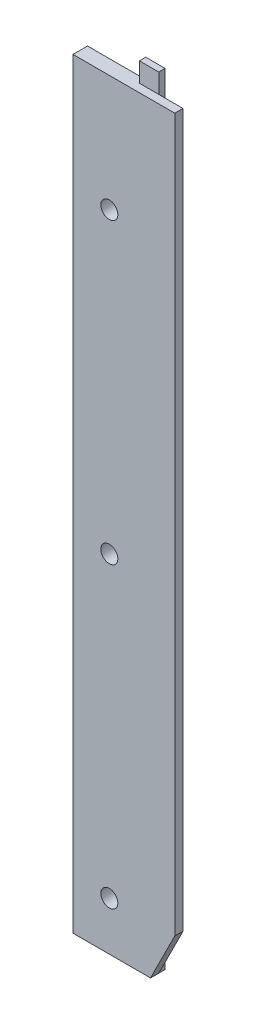
ISO-10303-21;
HEADER;
FILE_DESCRIPTION(('STEP AP214'),'2;1');
FILE_NAME('part.step','',(''),(''),'','','');
FILE_SCHEMA(('AUTOMOTIVE_DESIGN { 1 0 10303 214 1 1 1 1 }'));
ENDSEC;
DATA;
#1=APPLICATION_CONTEXT('core data for automotive mechanical design processes');
#2=APPLICATION_PROTOCOL_DEFINITION('international standard','automotive_design',2000,#1);
#3=PRODUCT_CONTEXT('',#1,'mechanical');
#4=PRODUCT('Part','Part','',(#3));
#5=PRODUCT_RELATED_PRODUCT_CATEGORY('part','',(#4));
#6=PRODUCT_DEFINITION_FORMATION('','',#4);
#7=PRODUCT_DEFINITION_CONTEXT('part definition',#1,'design');
#8=PRODUCT_DEFINITION('design','',#6,#7);
#9=PRODUCT_DEFINITION_SHAPE('','',#8);
#10=(LENGTH_UNIT() NAMED_UNIT(*) SI_UNIT(.MILLI.,.METRE.));
#11=(NAMED_UNIT(*) PLANE_ANGLE_UNIT() SI_UNIT($,.RADIAN.));
#12=(NAMED_UNIT(*) SI_UNIT($,.STERADIAN.) SOLID_ANGLE_UNIT());
#13=UNCERTAINTY_MEASURE_WITH_UNIT(LENGTH_MEASURE(1.E-05),#10,'distance_accuracy_value','');
#14=(GEOMETRIC_REPRESENTATION_CONTEXT(3) GLOBAL_UNCERTAINTY_ASSIGNED_CONTEXT((#13)) GLOBAL_UNIT_ASSIGNED_CONTEXT((#10,
#11,#12)) REPRESENTATION_CONTEXT('',''));
#15=CARTESIAN_POINT('',(0.,0.,0.));
#16=DIRECTION('',(0.,0.,1.));
#17=DIRECTION('',(1.,0.,0.));
#18=AXIS2_PLACEMENT_3D('',#15,#16,#17);
#19=CARTESIAN_POINT('',(10.5,-78.5,1.7));
#20=DIRECTION('',(-1.,0.,0.));
#21=DIRECTION('',(0.,0.,1.));
#22=AXIS2_PLACEMENT_3D('',#19,#20,#21);
#23=PLANE('',#22);
#24=DIRECTION('',(0.,1.,0.));
#25=VECTOR('',#24,1.);
#26=CARTESIAN_POINT('',(10.5,-78.5,1.7));
#27=LINE('',#26,#25);
#28=CARTESIAN_POINT('',(10.5,-68.5007358950624,1.7));
#29=VERTEX_POINT('',#28);
#30=CARTESIAN_POINT('',(10.5,78.5,1.7));
#31=VERTEX_POINT('',#30);
#32=EDGE_CURVE('E36',#29,#31,#27,.T.);
#33=ORIENTED_EDGE('',*,*,#32,.F.);
#34=DIRECTION('',(0.,0.,1.));
#35=VECTOR('',#34,1.);
#36=CARTESIAN_POINT('',(10.5,-68.5007358950624,-1.3));
#37=LINE('',#36,#35);
#38=CARTESIAN_POINT('',(10.5,-68.5007358950624,0.));
#39=VERTEX_POINT('',#38);
#40=EDGE_CURVE('E107',#39,#29,#37,.T.);
#41=ORIENTED_EDGE('',*,*,#40,.F.);
#42=DIRECTION('',(0.,1.,0.));
#43=VECTOR('',#42,1.);
#44=CARTESIAN_POINT('',(10.5,-78.5,0.));
#45=LINE('',#44,#43);
#46=CARTESIAN_POINT('',(10.5,78.5,0.));
#47=VERTEX_POINT('',#46);
#48=EDGE_CURVE('E134',#39,#47,#45,.T.);
#49=ORIENTED_EDGE('',*,*,#48,.T.);
#50=DIRECTION('',(0.,0.,-1.));
#51=VECTOR('',#50,1.);
#52=CARTESIAN_POINT('',(10.5,78.5,1.7));
#53=LINE('',#52,#51);
#54=EDGE_CURVE('E127',#31,#47,#53,.T.);
#55=ORIENTED_EDGE('',*,*,#54,.F.);
#56=EDGE_LOOP('',(#33,#41,#49,#55));
#57=FACE_BOUND('',#56,.T.);
#58=ADVANCED_FACE('F33',(#57),#23,.F.);
#59=CARTESIAN_POINT('',(-10.5,78.5,1.7));
#60=DIRECTION('',(0.,-1.,0.));
#61=DIRECTION('',(0.,0.,-1.));
#62=AXIS2_PLACEMENT_3D('',#59,#60,#61);
#63=PLANE('',#62);
#64=DIRECTION('',(-1.,0.,0.));
#65=VECTOR('',#64,1.);
#66=CARTESIAN_POINT('',(-10.5,78.5,0.));
#67=LINE('',#66,#65);
#68=CARTESIAN_POINT('',(5.5,78.5,0.));
#69=VERTEX_POINT('',#68);
#70=EDGE_CURVE('E129',#47,#69,#67,.T.);
#71=ORIENTED_EDGE('',*,*,#70,.T.);
#72=CARTESIAN_POINT('',(1.50000000000001,78.5,0.));
#73=VERTEX_POINT('',#72);
#74=EDGE_CURVE('E56',#69,#73,#67,.T.);
#75=ORIENTED_EDGE('',*,*,#74,.T.);
#76=DIRECTION('',(0.,0.,1.));
#77=VECTOR('',#76,1.);
#78=CARTESIAN_POINT('',(1.50000000000002,78.5,-1.3));
#79=LINE('',#78,#77);
#80=CARTESIAN_POINT('',(1.50000000000002,78.5,-1.3));
#81=VERTEX_POINT('',#80);
#82=EDGE_CURVE('E196',#81,#73,#79,.T.);
#83=ORIENTED_EDGE('',*,*,#82,.F.);
#84=DIRECTION('',(1.,0.,0.));
#85=VECTOR('',#84,1.);
#86=CARTESIAN_POINT('',(-10.5,78.5,-1.3));
#87=LINE('',#86,#85);
#88=CARTESIAN_POINT('',(-10.5,78.5,-1.3));
#89=VERTEX_POINT('',#88);
#90=EDGE_CURVE('E184',#89,#81,#87,.T.);
#91=ORIENTED_EDGE('',*,*,#90,.F.);
#92=DIRECTION('',(0.,0.,-1.));
#93=VECTOR('',#92,1.);
#94=CARTESIAN_POINT('',(-10.5,78.5,1.7));
#95=LINE('',#94,#93);
#96=CARTESIAN_POINT('',(-10.5,78.5,1.7));
#97=VERTEX_POINT('',#96);
#98=EDGE_CURVE('E141',#97,#89,#95,.T.);
#99=ORIENTED_EDGE('',*,*,#98,.F.);
#100=DIRECTION('',(-1.,0.,0.));
#101=VECTOR('',#100,1.);
#102=CARTESIAN_POINT('',(-10.5,78.5,1.7));
#103=LINE('',#102,#101);
#104=EDGE_CURVE('E128',#31,#97,#103,.T.);
#105=ORIENTED_EDGE('',*,*,#104,.F.);
#106=ORIENTED_EDGE('',*,*,#54,.T.);
#107=EDGE_LOOP('',(#71,#75,#83,#91,#99,#105,#106));
#108=FACE_BOUND('',#107,.T.);
#109=ADVANCED_FACE('F220',(#108),#63,.F.);
#110=CARTESIAN_POINT('',(-10.5,-78.5,1.7));
#111=DIRECTION('',(1.,0.,0.));
#112=DIRECTION('',(0.,0.,-1.));
#113=AXIS2_PLACEMENT_3D('',#110,#111,#112);
#114=PLANE('',#113);
#115=ORIENTED_EDGE('',*,*,#98,.T.);
#116=DIRECTION('',(0.,1.,0.));
#117=VECTOR('',#116,1.);
#118=CARTESIAN_POINT('',(-10.5,-78.5,-1.3));
#119=LINE('',#118,#117);
#120=CARTESIAN_POINT('',(-10.5,-78.5,-1.3));
#121=VERTEX_POINT('',#120);
#122=EDGE_CURVE('E181',#121,#89,#119,.T.);
#123=ORIENTED_EDGE('',*,*,#122,.F.);
#124=DIRECTION('',(0.,0.,-1.));
#125=VECTOR('',#124,1.);
#126=CARTESIAN_POINT('',(-10.5,-78.5,1.7));
#127=LINE('',#126,#125);
#128=CARTESIAN_POINT('',(-10.5,-78.5,1.7));
#129=VERTEX_POINT('',#128);
#130=EDGE_CURVE('E138',#129,#121,#127,.T.);
#131=ORIENTED_EDGE('',*,*,#130,.F.);
#132=DIRECTION('',(0.,-1.,0.));
#133=VECTOR('',#132,1.);
#134=CARTESIAN_POINT('',(-10.5,-78.5,1.7));
#135=LINE('',#134,#133);
#136=EDGE_CURVE('E130',#97,#129,#135,.T.);
#137=ORIENTED_EDGE('',*,*,#136,.F.);
#138=EDGE_LOOP('',(#115,#123,#131,#137));
#139=FACE_BOUND('',#138,.T.);
#140=ADVANCED_FACE('F207',(#139),#114,.F.);
#141=CARTESIAN_POINT('',(-10.5,-78.5,1.7));
#142=DIRECTION('',(0.,1.,0.));
#143=DIRECTION('',(0.,0.,1.));
#144=AXIS2_PLACEMENT_3D('',#141,#142,#143);
#145=PLANE('',#144);
#146=DIRECTION('',(-1.,0.,0.));
#147=VECTOR('',#146,1.);
#148=CARTESIAN_POINT('',(5.5,-78.5,-1.3));
#149=LINE('',#148,#147);
#150=CARTESIAN_POINT('',(5.49928831467883,-78.5,-1.3));
#151=VERTEX_POINT('',#150);
#152=EDGE_CURVE('E179',#151,#121,#149,.T.);
#153=ORIENTED_EDGE('',*,*,#152,.F.);
#154=DIRECTION('',(0.,0.,1.));
#155=VECTOR('',#154,1.);
#156=CARTESIAN_POINT('',(5.49928831467885,-78.5,-1.3));
#157=LINE('',#156,#155);
#158=CARTESIAN_POINT('',(5.49928831467885,-78.5,1.7));
#159=VERTEX_POINT('',#158);
#160=EDGE_CURVE('E49',#151,#159,#157,.T.);
#161=ORIENTED_EDGE('',*,*,#160,.T.);
#162=DIRECTION('',(1.,0.,0.));
#163=VECTOR('',#162,1.);
#164=CARTESIAN_POINT('',(-10.5,-78.5,1.7));
#165=LINE('',#164,#163);
#166=EDGE_CURVE('E122',#129,#159,#165,.T.);
#167=ORIENTED_EDGE('',*,*,#166,.F.);
#168=ORIENTED_EDGE('',*,*,#130,.T.);
#169=EDGE_LOOP('',(#153,#161,#167,#168));
#170=FACE_BOUND('',#169,.T.);
#171=ADVANCED_FACE('F210',(#170),#145,.F.);
#172=CARTESIAN_POINT('',(0.,0.,1.7));
#173=DIRECTION('',(0.,0.,-1.));
#174=DIRECTION('',(-1.,0.,0.));
#175=AXIS2_PLACEMENT_3D('',#172,#173,#174);
#176=PLANE('',#175);
#177=CARTESIAN_POINT('',(-3.,54.5,1.7));
#178=DIRECTION('',(0.,0.,1.));
#179=DIRECTION('',(1.,0.,0.));
#180=AXIS2_PLACEMENT_3D('',#177,#178,#179);
#181=CIRCLE('',#180,1.75);
#182=CARTESIAN_POINT('',(-1.25,54.5,1.7));
#183=VERTEX_POINT('',#182);
#184=EDGE_CURVE('E156',#183,#183,#181,.T.);
#185=ORIENTED_EDGE('',*,*,#184,.F.);
#186=EDGE_LOOP('',(#185));
#187=FACE_BOUND('',#186,.T.);
#188=CARTESIAN_POINT('',(-3.,-6.99999999999999,1.7));
#189=DIRECTION('',(0.,0.,1.));
#190=DIRECTION('',(1.,0.,0.));
#191=AXIS2_PLACEMENT_3D('',#188,#189,#190);
#192=CIRCLE('',#191,1.75);
#193=CARTESIAN_POINT('',(-1.25,-6.99999999999999,1.7));
#194=VERTEX_POINT('',#193);
#195=EDGE_CURVE('E168',#194,#194,#192,.T.);
#196=ORIENTED_EDGE('',*,*,#195,.F.);
#197=EDGE_LOOP('',(#196));
#198=FACE_BOUND('',#197,.T.);
#199=CARTESIAN_POINT('',(-3.,-68.5,1.7));
#200=DIRECTION('',(0.,0.,1.));
#201=DIRECTION('',(1.,0.,0.));
#202=AXIS2_PLACEMENT_3D('',#199,#200,#201);
#203=CIRCLE('',#202,1.75);
#204=CARTESIAN_POINT('',(-1.25,-68.5,1.7));
#205=VERTEX_POINT('',#204);
#206=EDGE_CURVE('E123',#205,#205,#203,.T.);
#207=ORIENTED_EDGE('',*,*,#206,.F.);
#208=EDGE_LOOP('',(#207));
#209=FACE_BOUND('',#208,.T.);
#210=ORIENTED_EDGE('',*,*,#166,.T.);
#211=DIRECTION('',(0.447290848418708,0.894388560370085,0.));
#212=VECTOR('',#211,1.);
#213=CARTESIAN_POINT('',(35.8031183457254,-17.9054248796165,1.7));
#214=LINE('',#213,#212);
#215=EDGE_CURVE('E110',#159,#29,#214,.T.);
#216=ORIENTED_EDGE('',*,*,#215,.T.);
#217=ORIENTED_EDGE('',*,*,#32,.T.);
#218=ORIENTED_EDGE('',*,*,#104,.T.);
#219=ORIENTED_EDGE('',*,*,#136,.T.);
#220=EDGE_LOOP('',(#210,#216,#217,#218,#219));
#221=FACE_BOUND('',#220,.T.);
#222=ADVANCED_FACE('F119',(#187,#198,#209,#221),#176,.F.);
#223=CARTESIAN_POINT('',(0.,0.,0.));
#224=DIRECTION('',(0.,0.,-1.));
#225=DIRECTION('',(-1.,0.,0.));
#226=AXIS2_PLACEMENT_3D('',#223,#224,#225);
#227=PLANE('',#226);
#228=DIRECTION('',(0.447290848418708,0.894388560370085,0.));
#229=VECTOR('',#228,1.);
#230=CARTESIAN_POINT('',(35.8031183457254,-17.9054248796165,0.));
#231=LINE('',#230,#229);
#232=CARTESIAN_POINT('',(5.5,-78.4985769366575,0.));
#233=VERTEX_POINT('',#232);
#234=EDGE_CURVE('E112',#233,#39,#231,.T.);
#235=ORIENTED_EDGE('',*,*,#234,.F.);
#236=DIRECTION('',(0.,-1.,0.));
#237=VECTOR('',#236,1.);
#238=CARTESIAN_POINT('',(5.50000000000002,78.5,0.));
#239=LINE('',#238,#237);
#240=EDGE_CURVE('E42',#69,#233,#239,.T.);
#241=ORIENTED_EDGE('',*,*,#240,.F.);
#242=ORIENTED_EDGE('',*,*,#70,.F.);
#243=ORIENTED_EDGE('',*,*,#48,.F.);
#244=EDGE_LOOP('',(#235,#241,#242,#243));
#245=FACE_BOUND('',#244,.T.);
#246=ADVANCED_FACE('F233',(#245),#227,.T.);
#247=CARTESIAN_POINT('',(0.,0.,0.));
#248=DIRECTION('',(0.,0.,1.));
#249=DIRECTION('',(1.,0.,0.));
#250=AXIS2_PLACEMENT_3D('',#247,#248,#249);
#251=PLANE('',#250);
#252=ORIENTED_EDGE('',*,*,#74,.F.);
#253=CARTESIAN_POINT('',(5.50000000000002,82.5,0.));
#254=VERTEX_POINT('',#253);
#255=EDGE_CURVE('E145',#254,#69,#239,.T.);
#256=ORIENTED_EDGE('',*,*,#255,.F.);
#257=DIRECTION('',(1.,0.,0.));
#258=VECTOR('',#257,1.);
#259=CARTESIAN_POINT('',(5.50000000000002,82.5,0.));
#260=LINE('',#259,#258);
#261=CARTESIAN_POINT('',(1.50000000000002,82.5,0.));
#262=VERTEX_POINT('',#261);
#263=EDGE_CURVE('E154',#262,#254,#260,.T.);
#264=ORIENTED_EDGE('',*,*,#263,.F.);
#265=DIRECTION('',(0.,1.,0.));
#266=VECTOR('',#265,1.);
#267=CARTESIAN_POINT('',(1.50000000000002,82.5,0.));
#268=LINE('',#267,#266);
#269=EDGE_CURVE('E151',#73,#262,#268,.T.);
#270=ORIENTED_EDGE('',*,*,#269,.F.);
#271=EDGE_LOOP('',(#252,#256,#264,#270));
#272=FACE_BOUND('',#271,.T.);
#273=ADVANCED_FACE('F231',(#272),#251,.T.);
#274=CARTESIAN_POINT('',(5.50000000000002,78.5,-1.3));
#275=DIRECTION('',(-1.,0.,0.));
#276=DIRECTION('',(0.,-1.,0.));
#277=AXIS2_PLACEMENT_3D('',#274,#275,#276);
#278=PLANE('',#277);
#279=ORIENTED_EDGE('',*,*,#240,.T.);
#280=DIRECTION('',(0.,0.,-1.));
#281=VECTOR('',#280,1.);
#282=CARTESIAN_POINT('',(5.5,-78.4985769366575,-1.3));
#283=LINE('',#282,#281);
#284=CARTESIAN_POINT('',(5.50000000000002,-78.4985769366574,-1.3));
#285=VERTEX_POINT('',#284);
#286=EDGE_CURVE('E211',#233,#285,#283,.T.);
#287=ORIENTED_EDGE('',*,*,#286,.T.);
#288=DIRECTION('',(0.,-1.,0.));
#289=VECTOR('',#288,1.);
#290=CARTESIAN_POINT('',(5.50000000000002,78.5,-1.3));
#291=LINE('',#290,#289);
#292=CARTESIAN_POINT('',(5.50000000000002,82.5,-1.3));
#293=VERTEX_POINT('',#292);
#294=EDGE_CURVE('E176',#293,#285,#291,.T.);
#295=ORIENTED_EDGE('',*,*,#294,.F.);
#296=DIRECTION('',(0.,0.,1.));
#297=VECTOR('',#296,1.);
#298=CARTESIAN_POINT('',(5.50000000000002,82.5,-1.3));
#299=LINE('',#298,#297);
#300=EDGE_CURVE('E188',#293,#254,#299,.T.);
#301=ORIENTED_EDGE('',*,*,#300,.T.);
#302=ORIENTED_EDGE('',*,*,#255,.T.);
#303=EDGE_LOOP('',(#279,#287,#295,#301,#302));
#304=FACE_BOUND('',#303,.T.);
#305=ADVANCED_FACE('F217',(#304),#278,.F.);
#306=CARTESIAN_POINT('',(1.50000000000002,82.5,-1.3));
#307=DIRECTION('',(1.,0.,0.));
#308=DIRECTION('',(0.,1.,0.));
#309=AXIS2_PLACEMENT_3D('',#306,#307,#308);
#310=PLANE('',#309);
#311=ORIENTED_EDGE('',*,*,#269,.T.);
#312=DIRECTION('',(0.,0.,1.));
#313=VECTOR('',#312,1.);
#314=CARTESIAN_POINT('',(1.50000000000002,82.5,-1.3));
#315=LINE('',#314,#313);
#316=CARTESIAN_POINT('',(1.50000000000002,82.5,-1.3));
#317=VERTEX_POINT('',#316);
#318=EDGE_CURVE('E192',#317,#262,#315,.T.);
#319=ORIENTED_EDGE('',*,*,#318,.F.);
#320=DIRECTION('',(0.,1.,0.));
#321=VECTOR('',#320,1.);
#322=CARTESIAN_POINT('',(1.50000000000002,82.5,-1.3));
#323=LINE('',#322,#321);
#324=EDGE_CURVE('E186',#81,#317,#323,.T.);
#325=ORIENTED_EDGE('',*,*,#324,.F.);
#326=ORIENTED_EDGE('',*,*,#82,.T.);
#327=EDGE_LOOP('',(#311,#319,#325,#326));
#328=FACE_BOUND('',#327,.T.);
#329=ADVANCED_FACE('F225',(#328),#310,.F.);
#330=CARTESIAN_POINT('',(5.50000000000002,82.5,-1.3));
#331=DIRECTION('',(0.,-1.,0.));
#332=DIRECTION('',(0.,0.,-1.));
#333=AXIS2_PLACEMENT_3D('',#330,#331,#332);
#334=PLANE('',#333);
#335=ORIENTED_EDGE('',*,*,#263,.T.);
#336=ORIENTED_EDGE('',*,*,#300,.F.);
#337=DIRECTION('',(1.,0.,0.));
#338=VECTOR('',#337,1.);
#339=CARTESIAN_POINT('',(5.50000000000002,82.5,-1.3));
#340=LINE('',#339,#338);
#341=EDGE_CURVE('E187',#317,#293,#340,.T.);
#342=ORIENTED_EDGE('',*,*,#341,.F.);
#343=ORIENTED_EDGE('',*,*,#318,.T.);
#344=EDGE_LOOP('',(#335,#336,#342,#343));
#345=FACE_BOUND('',#344,.T.);
#346=ADVANCED_FACE('F229',(#345),#334,.F.);
#347=CARTESIAN_POINT('',(0.,0.,-1.3));
#348=DIRECTION('',(0.,0.,1.));
#349=DIRECTION('',(1.,0.,0.));
#350=AXIS2_PLACEMENT_3D('',#347,#348,#349);
#351=PLANE('',#350);
#352=CARTESIAN_POINT('',(-3.,54.5,-1.3));
#353=DIRECTION('',(0.,0.,1.));
#354=DIRECTION('',(1.,0.,0.));
#355=AXIS2_PLACEMENT_3D('',#352,#353,#354);
#356=CIRCLE('',#355,1.75);
#357=CARTESIAN_POINT('',(-1.25,54.5,-1.3));
#358=VERTEX_POINT('',#357);
#359=EDGE_CURVE('E152',#358,#358,#356,.T.);
#360=ORIENTED_EDGE('',*,*,#359,.T.);
#361=EDGE_LOOP('',(#360));
#362=FACE_BOUND('',#361,.T.);
#363=CARTESIAN_POINT('',(-3.,-6.99999999999999,-1.3));
#364=DIRECTION('',(0.,0.,1.));
#365=DIRECTION('',(1.,0.,0.));
#366=AXIS2_PLACEMENT_3D('',#363,#364,#365);
#367=CIRCLE('',#366,1.75);
#368=CARTESIAN_POINT('',(-1.25,-6.99999999999999,-1.3));
#369=VERTEX_POINT('',#368);
#370=EDGE_CURVE('E161',#369,#369,#367,.T.);
#371=ORIENTED_EDGE('',*,*,#370,.T.);
#372=EDGE_LOOP('',(#371));
#373=FACE_BOUND('',#372,.T.);
#374=CARTESIAN_POINT('',(-3.,-68.5,-1.3));
#375=DIRECTION('',(0.,0.,1.));
#376=DIRECTION('',(1.,0.,0.));
#377=AXIS2_PLACEMENT_3D('',#374,#375,#376);
#378=CIRCLE('',#377,1.75);
#379=CARTESIAN_POINT('',(-1.25,-68.5,-1.3));
#380=VERTEX_POINT('',#379);
#381=EDGE_CURVE('E171',#380,#380,#378,.T.);
#382=ORIENTED_EDGE('',*,*,#381,.T.);
#383=EDGE_LOOP('',(#382));
#384=FACE_BOUND('',#383,.T.);
#385=ORIENTED_EDGE('',*,*,#294,.T.);
#386=DIRECTION('',(-0.447290848418708,-0.894388560370085,0.));
#387=VECTOR('',#386,1.);
#388=CARTESIAN_POINT('',(35.8031183457254,-17.9054248796165,-1.3));
#389=LINE('',#388,#387);
#390=EDGE_CURVE('E11',#285,#151,#389,.T.);
#391=ORIENTED_EDGE('',*,*,#390,.T.);
#392=ORIENTED_EDGE('',*,*,#152,.T.);
#393=ORIENTED_EDGE('',*,*,#122,.T.);
#394=ORIENTED_EDGE('',*,*,#90,.T.);
#395=ORIENTED_EDGE('',*,*,#324,.T.);
#396=ORIENTED_EDGE('',*,*,#341,.T.);
#397=EDGE_LOOP('',(#385,#391,#392,#393,#394,#395,#396));
#398=FACE_BOUND('',#397,.T.);
#399=ADVANCED_FACE('F218',(#362,#373,#384,#398),#351,.F.);
#400=CARTESIAN_POINT('',(-3.,-68.5,-1.3));
#401=DIRECTION('',(0.,0.,1.));
#402=DIRECTION('',(1.,0.,0.));
#403=AXIS2_PLACEMENT_3D('',#400,#401,#402);
#404=CYLINDRICAL_SURFACE('',#403,1.75);
#405=ORIENTED_EDGE('',*,*,#381,.F.);
#406=EDGE_LOOP('',(#405));
#407=FACE_BOUND('',#406,.T.);
#408=ORIENTED_EDGE('',*,*,#206,.T.);
#409=EDGE_LOOP('',(#408));
#410=FACE_BOUND('',#409,.T.);
#411=ADVANCED_FACE('F263',(#407,#410),#404,.F.);
#412=CARTESIAN_POINT('',(-3.,-6.99999999999999,-1.3));
#413=DIRECTION('',(0.,0.,1.));
#414=DIRECTION('',(1.,0.,0.));
#415=AXIS2_PLACEMENT_3D('',#412,#413,#414);
#416=CYLINDRICAL_SURFACE('',#415,1.75);
#417=ORIENTED_EDGE('',*,*,#370,.F.);
#418=EDGE_LOOP('',(#417));
#419=FACE_BOUND('',#418,.T.);
#420=ORIENTED_EDGE('',*,*,#195,.T.);
#421=EDGE_LOOP('',(#420));
#422=FACE_BOUND('',#421,.T.);
#423=ADVANCED_FACE('F267',(#419,#422),#416,.F.);
#424=CARTESIAN_POINT('',(-3.,54.5,-1.3));
#425=DIRECTION('',(0.,0.,1.));
#426=DIRECTION('',(1.,0.,0.));
#427=AXIS2_PLACEMENT_3D('',#424,#425,#426);
#428=CYLINDRICAL_SURFACE('',#427,1.75);
#429=ORIENTED_EDGE('',*,*,#359,.F.);
#430=EDGE_LOOP('',(#429));
#431=FACE_BOUND('',#430,.T.);
#432=ORIENTED_EDGE('',*,*,#184,.T.);
#433=EDGE_LOOP('',(#432));
#434=FACE_BOUND('',#433,.T.);
#435=ADVANCED_FACE('F274',(#431,#434),#428,.F.);
#436=CARTESIAN_POINT('',(5.49928831467885,-78.5,-1.3));
#437=DIRECTION('',(-0.894388560370085,0.447290848418708,0.));
#438=DIRECTION('',(-0.447290848418708,-0.894388560370085,0.));
#439=AXIS2_PLACEMENT_3D('',#436,#437,#438);
#440=PLANE('',#439);
#441=ORIENTED_EDGE('',*,*,#160,.F.);
#442=ORIENTED_EDGE('',*,*,#390,.F.);
#443=ORIENTED_EDGE('',*,*,#286,.F.);
#444=ORIENTED_EDGE('',*,*,#234,.T.);
#445=ORIENTED_EDGE('',*,*,#40,.T.);
#446=ORIENTED_EDGE('',*,*,#215,.F.);
#447=EDGE_LOOP('',(#441,#442,#443,#444,#445,#446));
#448=FACE_BOUND('',#447,.T.);
#449=ADVANCED_FACE('F109',(#448),#440,.F.);
#450=CLOSED_SHELL('',(#58,#109,#140,#171,#222,#246,#273,#305,#329,#346,#399,#411,#423,#435,#449));
#451=MANIFOLD_SOLID_BREP('B2',#450);
#452=ADVANCED_BREP_SHAPE_REPRESENTATION('',(#18,#451),#14);
#453=SHAPE_DEFINITION_REPRESENTATION(#9,#452);
ENDSEC;
END-ISO-10303-21;
